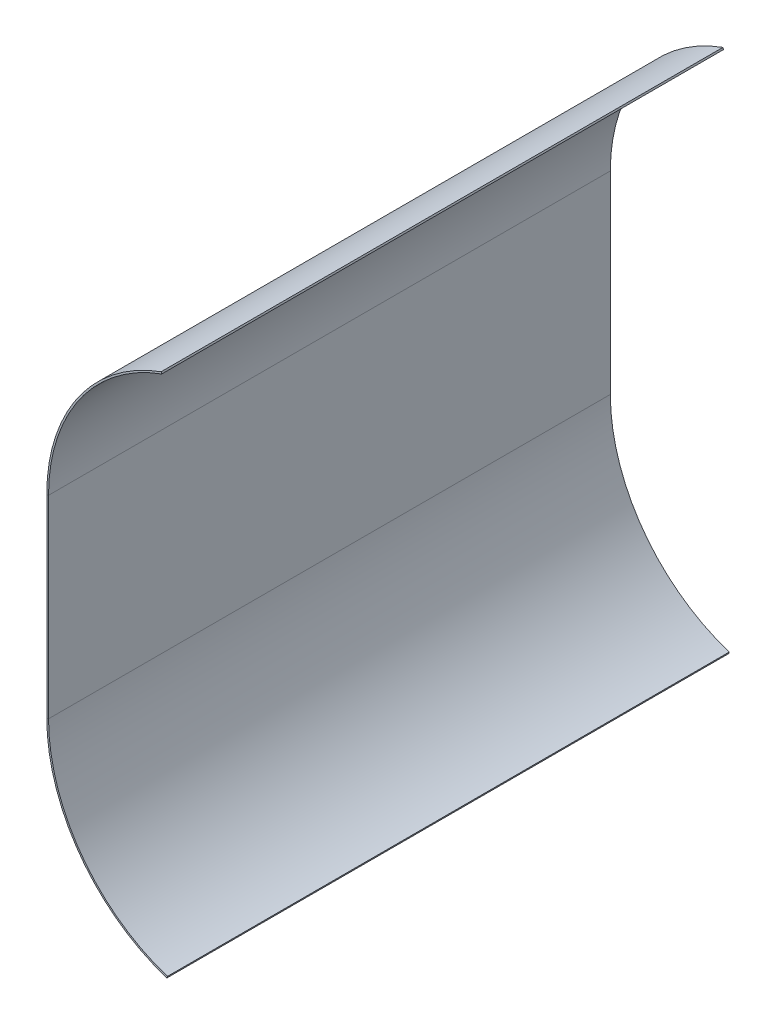
ISO-10303-21;
HEADER;
FILE_DESCRIPTION(('STEP AP214'),'2;1');
FILE_NAME('part.step','',(''),(''),'','','');
FILE_SCHEMA(('AUTOMOTIVE_DESIGN { 1 0 10303 214 1 1 1 1 }'));
ENDSEC;
DATA;
#1=APPLICATION_CONTEXT('core data for automotive mechanical design processes');
#2=APPLICATION_PROTOCOL_DEFINITION('international standard','automotive_design',2000,#1);
#3=PRODUCT_CONTEXT('',#1,'mechanical');
#4=PRODUCT('Part','Part','',(#3));
#5=PRODUCT_RELATED_PRODUCT_CATEGORY('part','',(#4));
#6=PRODUCT_DEFINITION_FORMATION('','',#4);
#7=PRODUCT_DEFINITION_CONTEXT('part definition',#1,'design');
#8=PRODUCT_DEFINITION('design','',#6,#7);
#9=PRODUCT_DEFINITION_SHAPE('','',#8);
#10=(LENGTH_UNIT() NAMED_UNIT(*) SI_UNIT(.MILLI.,.METRE.));
#11=(NAMED_UNIT(*) PLANE_ANGLE_UNIT() SI_UNIT($,.RADIAN.));
#12=(NAMED_UNIT(*) SI_UNIT($,.STERADIAN.) SOLID_ANGLE_UNIT());
#13=UNCERTAINTY_MEASURE_WITH_UNIT(LENGTH_MEASURE(1.E-05),#10,'distance_accuracy_value','');
#14=(GEOMETRIC_REPRESENTATION_CONTEXT(3) GLOBAL_UNCERTAINTY_ASSIGNED_CONTEXT((#13)) GLOBAL_UNIT_ASSIGNED_CONTEXT((#10,
#11,#12)) REPRESENTATION_CONTEXT('',''));
#15=CARTESIAN_POINT('',(0.,0.,0.));
#16=DIRECTION('',(0.,0.,1.));
#17=DIRECTION('',(1.,0.,0.));
#18=AXIS2_PLACEMENT_3D('',#15,#16,#17);
#19=CARTESIAN_POINT('',(-157.1625,0.,508.));
#20=DIRECTION('',(0.,0.,1.));
#21=DIRECTION('',(1.,0.,0.));
#22=AXIS2_PLACEMENT_3D('',#19,#20,#21);
#23=PLANE('',#22);
#24=DIRECTION('',(1.,0.,0.));
#25=VECTOR('',#24,1.);
#26=CARTESIAN_POINT('',(-157.1625,0.,508.));
#27=LINE('',#26,#25);
#28=CARTESIAN_POINT('',(-157.1625,0.,508.));
#29=VERTEX_POINT('',#28);
#30=CARTESIAN_POINT('',(-155.575,0.,508.));
#31=VERTEX_POINT('',#30);
#32=EDGE_CURVE('E11',#29,#31,#27,.T.);
#33=ORIENTED_EDGE('',*,*,#32,.F.);
#34=CARTESIAN_POINT('',(0.,0.,508.));
#35=DIRECTION('',(0.,0.,-1.));
#36=DIRECTION('',(1.,0.,0.));
#37=AXIS2_PLACEMENT_3D('',#34,#35,#36);
#38=CIRCLE('',#37,157.1625);
#39=CARTESIAN_POINT('',(-48.5658833784534,-149.470419742237,508.));
#40=VERTEX_POINT('',#39);
#41=EDGE_CURVE('E132',#40,#29,#38,.T.);
#42=ORIENTED_EDGE('',*,*,#41,.F.);
#43=DIRECTION('',(-0.30901699437495,-0.951056516295153,0.));
#44=VECTOR('',#43,1.);
#45=CARTESIAN_POINT('',(-48.0753188998831,-147.960617522618,508.));
#46=LINE('',#45,#44);
#47=CARTESIAN_POINT('',(-48.0753188998831,-147.960617522618,508.));
#48=VERTEX_POINT('',#47);
#49=EDGE_CURVE('E114',#48,#40,#46,.T.);
#50=ORIENTED_EDGE('',*,*,#49,.F.);
#51=CARTESIAN_POINT('',(0.,0.,508.));
#52=DIRECTION('',(0.,0.,1.));
#53=DIRECTION('',(1.,0.,0.));
#54=AXIS2_PLACEMENT_3D('',#51,#52,#53);
#55=CIRCLE('',#54,155.575);
#56=EDGE_CURVE('E123',#48,#31,#55,.F.);
#57=ORIENTED_EDGE('',*,*,#56,.T.);
#58=EDGE_LOOP('',(#33,#42,#50,#57));
#59=FACE_BOUND('',#58,.T.);
#60=ADVANCED_FACE('F38',(#59),#23,.T.);
#61=CARTESIAN_POINT('',(-155.575,0.,0.));
#62=DIRECTION('',(0.,0.,-1.));
#63=DIRECTION('',(-1.,0.,0.));
#64=AXIS2_PLACEMENT_3D('',#61,#62,#63);
#65=PLANE('',#64);
#66=DIRECTION('',(-1.,0.,0.));
#67=VECTOR('',#66,1.);
#68=CARTESIAN_POINT('',(-155.575,0.,0.));
#69=LINE('',#68,#67);
#70=CARTESIAN_POINT('',(-155.575,0.,0.));
#71=VERTEX_POINT('',#70);
#72=CARTESIAN_POINT('',(-157.1625,0.,0.));
#73=VERTEX_POINT('',#72);
#74=EDGE_CURVE('E46',#71,#73,#69,.T.);
#75=ORIENTED_EDGE('',*,*,#74,.F.);
#76=CARTESIAN_POINT('',(0.,0.,0.));
#77=DIRECTION('',(0.,0.,1.));
#78=DIRECTION('',(1.,0.,0.));
#79=AXIS2_PLACEMENT_3D('',#76,#77,#78);
#80=CIRCLE('',#79,155.575);
#81=CARTESIAN_POINT('',(-48.0753188998831,-147.960617522618,0.));
#82=VERTEX_POINT('',#81);
#83=EDGE_CURVE('E154',#82,#71,#80,.F.);
#84=ORIENTED_EDGE('',*,*,#83,.F.);
#85=DIRECTION('',(-0.30901699437495,-0.951056516295153,0.));
#86=VECTOR('',#85,1.);
#87=CARTESIAN_POINT('',(-48.0753188998831,-147.960617522618,0.));
#88=LINE('',#87,#86);
#89=CARTESIAN_POINT('',(-48.5658833784534,-149.470419742237,0.));
#90=VERTEX_POINT('',#89);
#91=EDGE_CURVE('E116',#82,#90,#88,.T.);
#92=ORIENTED_EDGE('',*,*,#91,.T.);
#93=CARTESIAN_POINT('',(0.,0.,0.));
#94=DIRECTION('',(0.,0.,-1.));
#95=DIRECTION('',(1.,0.,0.));
#96=AXIS2_PLACEMENT_3D('',#93,#94,#95);
#97=CIRCLE('',#96,157.1625);
#98=EDGE_CURVE('E151',#90,#73,#97,.T.);
#99=ORIENTED_EDGE('',*,*,#98,.T.);
#100=EDGE_LOOP('',(#75,#84,#92,#99));
#101=FACE_BOUND('',#100,.T.);
#102=ADVANCED_FACE('F185',(#101),#65,.T.);
#103=CARTESIAN_POINT('',(-155.575,175.02378,508.));
#104=DIRECTION('',(0.,0.,1.));
#105=DIRECTION('',(1.,0.,0.));
#106=AXIS2_PLACEMENT_3D('',#103,#104,#105);
#107=PLANE('',#106);
#108=DIRECTION('',(-1.,0.,0.));
#109=VECTOR('',#108,1.);
#110=CARTESIAN_POINT('',(-155.575,175.02378,508.));
#111=LINE('',#110,#109);
#112=CARTESIAN_POINT('',(-155.575,175.02378,508.));
#113=VERTEX_POINT('',#112);
#114=CARTESIAN_POINT('',(-157.1625,175.02378,508.));
#115=VERTEX_POINT('',#114);
#116=EDGE_CURVE('E54',#113,#115,#111,.T.);
#117=ORIENTED_EDGE('',*,*,#116,.F.);
#118=CARTESIAN_POINT('',(0.,175.02378,508.));
#119=DIRECTION('',(0.,0.,1.));
#120=DIRECTION('',(1.,0.,0.));
#121=AXIS2_PLACEMENT_3D('',#118,#119,#120);
#122=CIRCLE('',#121,155.575);
#123=CARTESIAN_POINT('',(-53.2097837978915,321.216459478767,508.));
#124=VERTEX_POINT('',#123);
#125=EDGE_CURVE('E94',#113,#124,#122,.F.);
#126=ORIENTED_EDGE('',*,*,#125,.T.);
#127=DIRECTION('',(0.342020143325684,-0.939692620785903,0.));
#128=VECTOR('',#127,1.);
#129=CARTESIAN_POINT('',(-53.752740775421,322.708221514265,508.));
#130=LINE('',#129,#128);
#131=CARTESIAN_POINT('',(-53.752740775421,322.708221514265,508.));
#132=VERTEX_POINT('',#131);
#133=EDGE_CURVE('E193',#132,#124,#130,.T.);
#134=ORIENTED_EDGE('',*,*,#133,.F.);
#135=CARTESIAN_POINT('',(0.,175.02378,508.));
#136=DIRECTION('',(0.,0.,-1.));
#137=DIRECTION('',(-1.,0.,0.));
#138=AXIS2_PLACEMENT_3D('',#135,#136,#137);
#139=CIRCLE('',#138,157.1625);
#140=EDGE_CURVE('E191',#115,#132,#139,.T.);
#141=ORIENTED_EDGE('',*,*,#140,.F.);
#142=EDGE_LOOP('',(#117,#126,#134,#141));
#143=FACE_BOUND('',#142,.T.);
#144=ADVANCED_FACE('F201',(#143),#107,.T.);
#145=CARTESIAN_POINT('',(-157.1625,175.02378,0.));
#146=DIRECTION('',(0.,0.,-1.));
#147=DIRECTION('',(-1.,0.,0.));
#148=AXIS2_PLACEMENT_3D('',#145,#146,#147);
#149=PLANE('',#148);
#150=DIRECTION('',(1.,0.,0.));
#151=VECTOR('',#150,1.);
#152=CARTESIAN_POINT('',(-157.1625,175.02378,0.));
#153=LINE('',#152,#151);
#154=CARTESIAN_POINT('',(-157.1625,175.02378,0.));
#155=VERTEX_POINT('',#154);
#156=CARTESIAN_POINT('',(-155.575,175.02378,0.));
#157=VERTEX_POINT('',#156);
#158=EDGE_CURVE('E88',#155,#157,#153,.T.);
#159=ORIENTED_EDGE('',*,*,#158,.F.);
#160=CARTESIAN_POINT('',(0.,175.02378,0.));
#161=DIRECTION('',(0.,0.,-1.));
#162=DIRECTION('',(-1.,0.,0.));
#163=AXIS2_PLACEMENT_3D('',#160,#161,#162);
#164=CIRCLE('',#163,157.1625);
#165=CARTESIAN_POINT('',(-53.752740775421,322.708221514265,0.));
#166=VERTEX_POINT('',#165);
#167=EDGE_CURVE('E146',#155,#166,#164,.T.);
#168=ORIENTED_EDGE('',*,*,#167,.T.);
#169=DIRECTION('',(0.342020143325684,-0.939692620785903,0.));
#170=VECTOR('',#169,1.);
#171=CARTESIAN_POINT('',(-53.752740775421,322.708221514265,0.));
#172=LINE('',#171,#170);
#173=CARTESIAN_POINT('',(-53.2097837978915,321.216459478767,0.));
#174=VERTEX_POINT('',#173);
#175=EDGE_CURVE('E143',#166,#174,#172,.T.);
#176=ORIENTED_EDGE('',*,*,#175,.T.);
#177=CARTESIAN_POINT('',(0.,175.02378,0.));
#178=DIRECTION('',(0.,0.,1.));
#179=DIRECTION('',(1.,0.,0.));
#180=AXIS2_PLACEMENT_3D('',#177,#178,#179);
#181=CIRCLE('',#180,155.575);
#182=EDGE_CURVE('E140',#157,#174,#181,.F.);
#183=ORIENTED_EDGE('',*,*,#182,.F.);
#184=EDGE_LOOP('',(#159,#168,#176,#183));
#185=FACE_BOUND('',#184,.T.);
#186=ADVANCED_FACE('F205',(#185),#149,.T.);
#187=CARTESIAN_POINT('',(0.,175.02378,508.));
#188=DIRECTION('',(0.,0.,-1.));
#189=DIRECTION('',(-1.,0.,0.));
#190=AXIS2_PLACEMENT_3D('',#187,#188,#189);
#191=CYLINDRICAL_SURFACE('',#190,155.575);
#192=ORIENTED_EDGE('',*,*,#182,.T.);
#193=DIRECTION('',(0.,0.,-1.));
#194=VECTOR('',#193,1.);
#195=CARTESIAN_POINT('',(-53.2097837978915,321.216459478767,508.));
#196=LINE('',#195,#194);
#197=EDGE_CURVE('E170',#124,#174,#196,.T.);
#198=ORIENTED_EDGE('',*,*,#197,.F.);
#199=ORIENTED_EDGE('',*,*,#125,.F.);
#200=DIRECTION('',(0.,0.,-1.));
#201=VECTOR('',#200,1.);
#202=CARTESIAN_POINT('',(-155.575,175.02378,508.));
#203=LINE('',#202,#201);
#204=EDGE_CURVE('E139',#113,#157,#203,.T.);
#205=ORIENTED_EDGE('',*,*,#204,.T.);
#206=EDGE_LOOP('',(#192,#198,#199,#205));
#207=FACE_BOUND('',#206,.T.);
#208=ADVANCED_FACE('F208',(#207),#191,.F.);
#209=CARTESIAN_POINT('',(-53.752740775421,322.708221514265,508.));
#210=DIRECTION('',(0.939692620785903,0.342020143325684,0.));
#211=DIRECTION('',(-0.342020143325684,0.939692620785903,0.));
#212=AXIS2_PLACEMENT_3D('',#209,#210,#211);
#213=PLANE('',#212);
#214=ORIENTED_EDGE('',*,*,#175,.F.);
#215=DIRECTION('',(0.,0.,-1.));
#216=VECTOR('',#215,1.);
#217=CARTESIAN_POINT('',(-53.752740775421,322.708221514265,508.));
#218=LINE('',#217,#216);
#219=EDGE_CURVE('E168',#132,#166,#218,.T.);
#220=ORIENTED_EDGE('',*,*,#219,.F.);
#221=ORIENTED_EDGE('',*,*,#133,.T.);
#222=ORIENTED_EDGE('',*,*,#197,.T.);
#223=EDGE_LOOP('',(#214,#220,#221,#222));
#224=FACE_BOUND('',#223,.T.);
#225=ADVANCED_FACE('F200',(#224),#213,.T.);
#226=CARTESIAN_POINT('',(0.,175.02378,508.));
#227=DIRECTION('',(0.,0.,-1.));
#228=DIRECTION('',(-1.,0.,0.));
#229=AXIS2_PLACEMENT_3D('',#226,#227,#228);
#230=CYLINDRICAL_SURFACE('',#229,157.1625);
#231=ORIENTED_EDGE('',*,*,#167,.F.);
#232=DIRECTION('',(0.,0.,-1.));
#233=VECTOR('',#232,1.);
#234=CARTESIAN_POINT('',(-157.1625,175.02378,508.));
#235=LINE('',#234,#233);
#236=EDGE_CURVE('E165',#115,#155,#235,.T.);
#237=ORIENTED_EDGE('',*,*,#236,.F.);
#238=ORIENTED_EDGE('',*,*,#140,.T.);
#239=ORIENTED_EDGE('',*,*,#219,.T.);
#240=EDGE_LOOP('',(#231,#237,#238,#239));
#241=FACE_BOUND('',#240,.T.);
#242=ADVANCED_FACE('F203',(#241),#230,.T.);
#243=CARTESIAN_POINT('',(-157.1625,0.,508.));
#244=DIRECTION('',(-1.,0.,0.));
#245=DIRECTION('',(0.,-1.,0.));
#246=AXIS2_PLACEMENT_3D('',#243,#244,#245);
#247=PLANE('',#246);
#248=DIRECTION('',(0.,1.,0.));
#249=VECTOR('',#248,1.);
#250=CARTESIAN_POINT('',(-157.1625,0.,0.));
#251=LINE('',#250,#249);
#252=EDGE_CURVE('E149',#73,#155,#251,.T.);
#253=ORIENTED_EDGE('',*,*,#252,.F.);
#254=DIRECTION('',(0.,0.,-1.));
#255=VECTOR('',#254,1.);
#256=CARTESIAN_POINT('',(-157.1625,0.,508.));
#257=LINE('',#256,#255);
#258=EDGE_CURVE('E162',#29,#73,#257,.T.);
#259=ORIENTED_EDGE('',*,*,#258,.F.);
#260=DIRECTION('',(0.,1.,0.));
#261=VECTOR('',#260,1.);
#262=CARTESIAN_POINT('',(-157.1625,0.,508.));
#263=LINE('',#262,#261);
#264=EDGE_CURVE('E134',#29,#115,#263,.T.);
#265=ORIENTED_EDGE('',*,*,#264,.T.);
#266=ORIENTED_EDGE('',*,*,#236,.T.);
#267=EDGE_LOOP('',(#253,#259,#265,#266));
#268=FACE_BOUND('',#267,.T.);
#269=ADVANCED_FACE('F182',(#268),#247,.T.);
#270=CARTESIAN_POINT('',(0.,0.,508.));
#271=DIRECTION('',(0.,0.,-1.));
#272=DIRECTION('',(-1.,0.,0.));
#273=AXIS2_PLACEMENT_3D('',#270,#271,#272);
#274=CYLINDRICAL_SURFACE('',#273,157.1625);
#275=ORIENTED_EDGE('',*,*,#98,.F.);
#276=DIRECTION('',(0.,0.,-1.));
#277=VECTOR('',#276,1.);
#278=CARTESIAN_POINT('',(-48.5658833784534,-149.470419742237,508.));
#279=LINE('',#278,#277);
#280=EDGE_CURVE('E118',#40,#90,#279,.T.);
#281=ORIENTED_EDGE('',*,*,#280,.F.);
#282=ORIENTED_EDGE('',*,*,#41,.T.);
#283=ORIENTED_EDGE('',*,*,#258,.T.);
#284=EDGE_LOOP('',(#275,#281,#282,#283));
#285=FACE_BOUND('',#284,.T.);
#286=ADVANCED_FACE('F178',(#285),#274,.T.);
#287=CARTESIAN_POINT('',(-48.0753188998831,-147.960617522618,508.));
#288=DIRECTION('',(0.951056516295153,-0.30901699437495,0.));
#289=DIRECTION('',(0.30901699437495,0.951056516295153,0.));
#290=AXIS2_PLACEMENT_3D('',#287,#288,#289);
#291=PLANE('',#290);
#292=ORIENTED_EDGE('',*,*,#91,.F.);
#293=DIRECTION('',(0.,0.,-1.));
#294=VECTOR('',#293,1.);
#295=CARTESIAN_POINT('',(-48.0753188998831,-147.960617522618,508.));
#296=LINE('',#295,#294);
#297=EDGE_CURVE('E110',#48,#82,#296,.T.);
#298=ORIENTED_EDGE('',*,*,#297,.F.);
#299=ORIENTED_EDGE('',*,*,#49,.T.);
#300=ORIENTED_EDGE('',*,*,#280,.T.);
#301=EDGE_LOOP('',(#292,#298,#299,#300));
#302=FACE_BOUND('',#301,.T.);
#303=ADVANCED_FACE('F112',(#302),#291,.T.);
#304=CARTESIAN_POINT('',(0.,0.,508.));
#305=DIRECTION('',(0.,0.,-1.));
#306=DIRECTION('',(-1.,0.,0.));
#307=AXIS2_PLACEMENT_3D('',#304,#305,#306);
#308=CYLINDRICAL_SURFACE('',#307,155.575);
#309=ORIENTED_EDGE('',*,*,#83,.T.);
#310=DIRECTION('',(0.,0.,-1.));
#311=VECTOR('',#310,1.);
#312=CARTESIAN_POINT('',(-155.575,0.,508.));
#313=LINE('',#312,#311);
#314=EDGE_CURVE('E119',#31,#71,#313,.T.);
#315=ORIENTED_EDGE('',*,*,#314,.F.);
#316=ORIENTED_EDGE('',*,*,#56,.F.);
#317=ORIENTED_EDGE('',*,*,#297,.T.);
#318=EDGE_LOOP('',(#309,#315,#316,#317));
#319=FACE_BOUND('',#318,.T.);
#320=ADVANCED_FACE('F124',(#319),#308,.F.);
#321=CARTESIAN_POINT('',(-155.575,0.,508.));
#322=DIRECTION('',(-1.,0.,0.));
#323=DIRECTION('',(0.,-1.,0.));
#324=AXIS2_PLACEMENT_3D('',#321,#322,#323);
#325=PLANE('',#324);
#326=DIRECTION('',(0.,1.,0.));
#327=VECTOR('',#326,1.);
#328=CARTESIAN_POINT('',(-155.575,0.,0.));
#329=LINE('',#328,#327);
#330=EDGE_CURVE('E156',#71,#157,#329,.T.);
#331=ORIENTED_EDGE('',*,*,#330,.T.);
#332=ORIENTED_EDGE('',*,*,#204,.F.);
#333=DIRECTION('',(0.,1.,0.));
#334=VECTOR('',#333,1.);
#335=CARTESIAN_POINT('',(-155.575,0.,508.));
#336=LINE('',#335,#334);
#337=EDGE_CURVE('E128',#31,#113,#336,.T.);
#338=ORIENTED_EDGE('',*,*,#337,.F.);
#339=ORIENTED_EDGE('',*,*,#314,.T.);
#340=EDGE_LOOP('',(#331,#332,#338,#339));
#341=FACE_BOUND('',#340,.T.);
#342=ADVANCED_FACE('F187',(#341),#325,.F.);
#343=CARTESIAN_POINT('',(0.,175.02378,508.));
#344=DIRECTION('',(0.,0.,1.));
#345=DIRECTION('',(1.,0.,0.));
#346=AXIS2_PLACEMENT_3D('',#343,#344,#345);
#347=PLANE('',#346);
#348=ORIENTED_EDGE('',*,*,#337,.T.);
#349=ORIENTED_EDGE('',*,*,#116,.T.);
#350=ORIENTED_EDGE('',*,*,#264,.F.);
#351=ORIENTED_EDGE('',*,*,#32,.T.);
#352=EDGE_LOOP('',(#348,#349,#350,#351));
#353=FACE_BOUND('',#352,.T.);
#354=ADVANCED_FACE('F190',(#353),#347,.T.);
#355=CARTESIAN_POINT('',(0.,175.02378,0.));
#356=DIRECTION('',(0.,0.,1.));
#357=DIRECTION('',(1.,0.,0.));
#358=AXIS2_PLACEMENT_3D('',#355,#356,#357);
#359=PLANE('',#358);
#360=ORIENTED_EDGE('',*,*,#252,.T.);
#361=ORIENTED_EDGE('',*,*,#158,.T.);
#362=ORIENTED_EDGE('',*,*,#330,.F.);
#363=ORIENTED_EDGE('',*,*,#74,.T.);
#364=EDGE_LOOP('',(#360,#361,#362,#363));
#365=FACE_BOUND('',#364,.T.);
#366=ADVANCED_FACE('F173',(#365),#359,.F.);
#367=CLOSED_SHELL('',(#60,#102,#144,#186,#208,#225,#242,#269,#286,#303,#320,#342,#354,#366));
#368=MANIFOLD_SOLID_BREP('B2',#367);
#369=ADVANCED_BREP_SHAPE_REPRESENTATION('',(#18,#368),#14);
#370=SHAPE_DEFINITION_REPRESENTATION(#9,#369);
ENDSEC;
END-ISO-10303-21;
